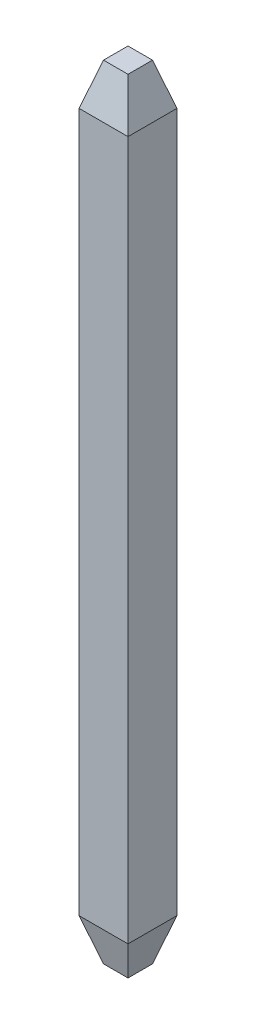
ISO-10303-21;
HEADER;
FILE_DESCRIPTION(('STEP AP214'),'2;1');
FILE_NAME('part.step','',(''),(''),'','','');
FILE_SCHEMA(('AUTOMOTIVE_DESIGN { 1 0 10303 214 1 1 1 1 }'));
ENDSEC;
DATA;
#1=APPLICATION_CONTEXT('core data for automotive mechanical design processes');
#2=APPLICATION_PROTOCOL_DEFINITION('international standard','automotive_design',2000,#1);
#3=PRODUCT_CONTEXT('',#1,'mechanical');
#4=PRODUCT('Part','Part','',(#3));
#5=PRODUCT_RELATED_PRODUCT_CATEGORY('part','',(#4));
#6=PRODUCT_DEFINITION_FORMATION('','',#4);
#7=PRODUCT_DEFINITION_CONTEXT('part definition',#1,'design');
#8=PRODUCT_DEFINITION('design','',#6,#7);
#9=PRODUCT_DEFINITION_SHAPE('','',#8);
#10=(LENGTH_UNIT() NAMED_UNIT(*) SI_UNIT(.MILLI.,.METRE.));
#11=(NAMED_UNIT(*) PLANE_ANGLE_UNIT() SI_UNIT($,.RADIAN.));
#12=(NAMED_UNIT(*) SI_UNIT($,.STERADIAN.) SOLID_ANGLE_UNIT());
#13=UNCERTAINTY_MEASURE_WITH_UNIT(LENGTH_MEASURE(1.E-05),#10,'distance_accuracy_value','');
#14=(GEOMETRIC_REPRESENTATION_CONTEXT(3) GLOBAL_UNCERTAINTY_ASSIGNED_CONTEXT((#13)) GLOBAL_UNIT_ASSIGNED_CONTEXT((#10,
#11,#12)) REPRESENTATION_CONTEXT('',''));
#15=CARTESIAN_POINT('',(0.,0.,0.));
#16=DIRECTION('',(0.,0.,1.));
#17=DIRECTION('',(1.,0.,0.));
#18=AXIS2_PLACEMENT_3D('',#15,#16,#17);
#19=CARTESIAN_POINT('',(-31.269999999987,-11.0738701069128,-16.9799999999763));
#20=DIRECTION('',(1.,0.,0.));
#21=DIRECTION('',(0.,1.,0.));
#22=AXIS2_PLACEMENT_3D('',#19,#20,#21);
#23=PLANE('',#22);
#24=DIRECTION('',(0.,1.,0.));
#25=VECTOR('',#24,1.);
#26=CARTESIAN_POINT('',(-31.269999999987,-10.1039999999833,-16.6599999999763));
#27=LINE('',#26,#25);
#28=CARTESIAN_POINT('',(-31.269999999987,-10.1039999999833,-16.6599999999763));
#29=VERTEX_POINT('',#28);
#30=CARTESIAN_POINT('',(-31.269999999987,-0.965870106912755,-16.6599999999763));
#31=VERTEX_POINT('',#30);
#32=EDGE_CURVE('E153',#29,#31,#27,.T.);
#33=ORIENTED_EDGE('',*,*,#32,.F.);
#34=DIRECTION('',(0.,0.,1.));
#35=VECTOR('',#34,1.);
#36=CARTESIAN_POINT('',(-31.269999999987,-10.1039999999833,-17.2999999999763));
#37=LINE('',#36,#35);
#38=CARTESIAN_POINT('',(-31.269999999987,-10.1039999999833,-17.2999999999763));
#39=VERTEX_POINT('',#38);
#40=EDGE_CURVE('E42',#39,#29,#37,.T.);
#41=ORIENTED_EDGE('',*,*,#40,.F.);
#42=DIRECTION('',(0.,1.,0.));
#43=VECTOR('',#42,1.);
#44=CARTESIAN_POINT('',(-31.269999999987,-10.1039999999833,-17.2999999999763));
#45=LINE('',#44,#43);
#46=CARTESIAN_POINT('',(-31.269999999987,-0.965870106912755,-17.2999999999763));
#47=VERTEX_POINT('',#46);
#48=EDGE_CURVE('E11',#39,#47,#45,.T.);
#49=ORIENTED_EDGE('',*,*,#48,.T.);
#50=DIRECTION('',(0.,0.,1.));
#51=VECTOR('',#50,1.);
#52=CARTESIAN_POINT('',(-31.269999999987,-0.965870106912753,-17.2999999999763));
#53=LINE('',#52,#51);
#54=EDGE_CURVE('E28',#47,#31,#53,.T.);
#55=ORIENTED_EDGE('',*,*,#54,.T.);
#56=EDGE_LOOP('',(#33,#41,#49,#55));
#57=FACE_BOUND('',#56,.T.);
#58=ADVANCED_FACE('F17',(#57),#23,.T.);
#59=CARTESIAN_POINT('',(-31.9109999999869,-5.53543505344803,-16.6599999999763));
#60=DIRECTION('',(0.,0.,1.));
#61=DIRECTION('',(1.,0.,0.));
#62=AXIS2_PLACEMENT_3D('',#59,#60,#61);
#63=PLANE('',#62);
#64=DIRECTION('',(0.,1.,0.));
#65=VECTOR('',#64,1.);
#66=CARTESIAN_POINT('',(-31.909999999987,-10.1039999999833,-16.6599999999763));
#67=LINE('',#66,#65);
#68=CARTESIAN_POINT('',(-31.909999999987,-10.1039999999833,-16.6599999999763));
#69=VERTEX_POINT('',#68);
#70=CARTESIAN_POINT('',(-31.909999999987,-0.965870106912755,-16.6599999999763));
#71=VERTEX_POINT('',#70);
#72=EDGE_CURVE('E21',#69,#71,#67,.T.);
#73=ORIENTED_EDGE('',*,*,#72,.F.);
#74=DIRECTION('',(-1.,0.,0.));
#75=VECTOR('',#74,1.);
#76=CARTESIAN_POINT('',(-31.269999999987,-10.1039999999833,-16.6599999999763));
#77=LINE('',#76,#75);
#78=EDGE_CURVE('E156',#29,#69,#77,.T.);
#79=ORIENTED_EDGE('',*,*,#78,.F.);
#80=ORIENTED_EDGE('',*,*,#32,.T.);
#81=DIRECTION('',(-1.,0.,0.));
#82=VECTOR('',#81,1.);
#83=CARTESIAN_POINT('',(-31.269999999987,-0.965870106912753,-16.6599999999763));
#84=LINE('',#83,#82);
#85=EDGE_CURVE('E185',#31,#71,#84,.T.);
#86=ORIENTED_EDGE('',*,*,#85,.T.);
#87=EDGE_LOOP('',(#73,#79,#80,#86));
#88=FACE_BOUND('',#87,.T.);
#89=ADVANCED_FACE('F268',(#88),#63,.T.);
#90=CARTESIAN_POINT('',(-31.909999999987,-5.53543505344803,-16.6589999999763));
#91=DIRECTION('',(-1.,0.,0.));
#92=DIRECTION('',(0.,0.,1.));
#93=AXIS2_PLACEMENT_3D('',#90,#91,#92);
#94=PLANE('',#93);
#95=DIRECTION('',(0.,1.,0.));
#96=VECTOR('',#95,1.);
#97=CARTESIAN_POINT('',(-31.909999999987,-10.1039999999833,-17.2999999999763));
#98=LINE('',#97,#96);
#99=CARTESIAN_POINT('',(-31.909999999987,-10.1039999999833,-17.2999999999763));
#100=VERTEX_POINT('',#99);
#101=CARTESIAN_POINT('',(-31.909999999987,-0.965870106912755,-17.2999999999763));
#102=VERTEX_POINT('',#101);
#103=EDGE_CURVE('E93',#100,#102,#98,.T.);
#104=ORIENTED_EDGE('',*,*,#103,.F.);
#105=DIRECTION('',(0.,0.,-1.));
#106=VECTOR('',#105,1.);
#107=CARTESIAN_POINT('',(-31.909999999987,-10.1039999999833,-16.6599999999763));
#108=LINE('',#107,#106);
#109=EDGE_CURVE('E98',#69,#100,#108,.T.);
#110=ORIENTED_EDGE('',*,*,#109,.F.);
#111=ORIENTED_EDGE('',*,*,#72,.T.);
#112=DIRECTION('',(0.,0.,-1.));
#113=VECTOR('',#112,1.);
#114=CARTESIAN_POINT('',(-31.909999999987,-0.965870106912753,-16.6599999999763));
#115=LINE('',#114,#113);
#116=EDGE_CURVE('E100',#71,#102,#115,.T.);
#117=ORIENTED_EDGE('',*,*,#116,.T.);
#118=EDGE_LOOP('',(#104,#110,#111,#117));
#119=FACE_BOUND('',#118,.T.);
#120=ADVANCED_FACE('F95',(#119),#94,.T.);
#121=CARTESIAN_POINT('',(-31.909999999987,-0.965870106912753,-16.9799999999763));
#122=DIRECTION('',(-0.959644900900968,0.281214622974644,0.));
#123=DIRECTION('',(0.,0.,1.));
#124=AXIS2_PLACEMENT_3D('',#121,#122,#123);
#125=PLANE('',#124);
#126=DIRECTION('',(0.270714017147727,0.923811583516617,-0.270714017147727));
#127=VECTOR('',#126,1.);
#128=CARTESIAN_POINT('',(-31.909999999987,-0.965870106912753,-16.6599999999763));
#129=LINE('',#128,#127);
#130=CARTESIAN_POINT('',(-31.749999999987,-0.419870106912756,-16.8199999999763));
#131=VERTEX_POINT('',#130);
#132=EDGE_CURVE('E149',#71,#131,#129,.T.);
#133=ORIENTED_EDGE('',*,*,#132,.T.);
#134=DIRECTION('',(0.,0.,-1.));
#135=VECTOR('',#134,1.);
#136=CARTESIAN_POINT('',(-31.749999999987,-0.419870106912754,-16.8199999999763));
#137=LINE('',#136,#135);
#138=CARTESIAN_POINT('',(-31.749999999987,-0.419870106912756,-17.1399999999763));
#139=VERTEX_POINT('',#138);
#140=EDGE_CURVE('E193',#131,#139,#137,.T.);
#141=ORIENTED_EDGE('',*,*,#140,.T.);
#142=DIRECTION('',(0.270714017147727,0.923811583516617,0.270714017147727));
#143=VECTOR('',#142,1.);
#144=CARTESIAN_POINT('',(-31.909999999987,-0.965870106912753,-17.2999999999763));
#145=LINE('',#144,#143);
#146=EDGE_CURVE('E191',#102,#139,#145,.T.);
#147=ORIENTED_EDGE('',*,*,#146,.F.);
#148=ORIENTED_EDGE('',*,*,#116,.F.);
#149=EDGE_LOOP('',(#133,#141,#147,#148));
#150=FACE_BOUND('',#149,.T.);
#151=ADVANCED_FACE('F216',(#150),#125,.T.);
#152=CARTESIAN_POINT('',(-31.589999999987,-0.965870106912753,-17.2999999999763));
#153=DIRECTION('',(0.,0.281214622974644,-0.959644900900968));
#154=DIRECTION('',(-1.,0.,0.));
#155=AXIS2_PLACEMENT_3D('',#152,#153,#154);
#156=PLANE('',#155);
#157=ORIENTED_EDGE('',*,*,#146,.T.);
#158=DIRECTION('',(1.,0.,0.));
#159=VECTOR('',#158,1.);
#160=CARTESIAN_POINT('',(-31.749999999987,-0.419870106912754,-17.1399999999763));
#161=LINE('',#160,#159);
#162=CARTESIAN_POINT('',(-31.429999999987,-0.419870106912756,-17.1399999999763));
#163=VERTEX_POINT('',#162);
#164=EDGE_CURVE('E129',#139,#163,#161,.T.);
#165=ORIENTED_EDGE('',*,*,#164,.T.);
#166=DIRECTION('',(-0.270714017147567,0.92381158351666,0.27071401714774));
#167=VECTOR('',#166,1.);
#168=CARTESIAN_POINT('',(-31.269999999987,-0.965870106912753,-17.2999999999763));
#169=LINE('',#168,#167);
#170=EDGE_CURVE('E157',#47,#163,#169,.T.);
#171=ORIENTED_EDGE('',*,*,#170,.F.);
#172=DIRECTION('',(1.,0.,0.));
#173=VECTOR('',#172,1.);
#174=CARTESIAN_POINT('',(-31.909999999987,-0.965870106912753,-17.2999999999763));
#175=LINE('',#174,#173);
#176=EDGE_CURVE('E108',#102,#47,#175,.T.);
#177=ORIENTED_EDGE('',*,*,#176,.F.);
#178=EDGE_LOOP('',(#157,#165,#171,#177));
#179=FACE_BOUND('',#178,.T.);
#180=ADVANCED_FACE('F204',(#179),#156,.T.);
#181=CARTESIAN_POINT('',(-31.589999999987,-0.419870106912754,-17.1409999999763));
#182=DIRECTION('',(0.,1.,0.));
#183=DIRECTION('',(1.,0.,0.));
#184=AXIS2_PLACEMENT_3D('',#181,#182,#183);
#185=PLANE('',#184);
#186=ORIENTED_EDGE('',*,*,#164,.F.);
#187=ORIENTED_EDGE('',*,*,#140,.F.);
#188=DIRECTION('',(-1.,0.,0.));
#189=VECTOR('',#188,1.);
#190=CARTESIAN_POINT('',(-31.4299999999869,-0.419870106912754,-16.8199999999763));
#191=LINE('',#190,#189);
#192=CARTESIAN_POINT('',(-31.429999999987,-0.419870106912756,-16.8199999999763));
#193=VERTEX_POINT('',#192);
#194=EDGE_CURVE('E160',#193,#131,#191,.T.);
#195=ORIENTED_EDGE('',*,*,#194,.F.);
#196=DIRECTION('',(0.,0.,1.));
#197=VECTOR('',#196,1.);
#198=CARTESIAN_POINT('',(-31.4299999999869,-0.419870106912754,-17.1399999999763));
#199=LINE('',#198,#197);
#200=EDGE_CURVE('E107',#163,#193,#199,.T.);
#201=ORIENTED_EDGE('',*,*,#200,.F.);
#202=EDGE_LOOP('',(#186,#187,#195,#201));
#203=FACE_BOUND('',#202,.T.);
#204=ADVANCED_FACE('F209',(#203),#185,.T.);
#205=CARTESIAN_POINT('',(-31.909999999987,-10.1039999999833,-16.9799999999763));
#206=DIRECTION('',(-0.959644900900969,-0.281214622974642,0.));
#207=DIRECTION('',(-0.281214622974642,0.959644900900969,0.));
#208=AXIS2_PLACEMENT_3D('',#205,#206,#207);
#209=PLANE('',#208);
#210=ORIENTED_EDGE('',*,*,#109,.T.);
#211=DIRECTION('',(0.270714017147726,-0.923811583516618,0.270714017147726));
#212=VECTOR('',#211,1.);
#213=CARTESIAN_POINT('',(-31.909999999987,-10.1039999999833,-17.2999999999763));
#214=LINE('',#213,#212);
#215=CARTESIAN_POINT('',(-31.749999999987,-10.6499999999833,-17.1399999999763));
#216=VERTEX_POINT('',#215);
#217=EDGE_CURVE('E114',#100,#216,#214,.T.);
#218=ORIENTED_EDGE('',*,*,#217,.T.);
#219=DIRECTION('',(0.,0.,-1.));
#220=VECTOR('',#219,1.);
#221=CARTESIAN_POINT('',(-31.749999999987,-10.6499999999833,-16.8199999999763));
#222=LINE('',#221,#220);
#223=CARTESIAN_POINT('',(-31.749999999987,-10.6499999999833,-16.8199999999763));
#224=VERTEX_POINT('',#223);
#225=EDGE_CURVE('E140',#224,#216,#222,.T.);
#226=ORIENTED_EDGE('',*,*,#225,.F.);
#227=DIRECTION('',(0.270714017147726,-0.923811583516618,-0.270714017147726));
#228=VECTOR('',#227,1.);
#229=CARTESIAN_POINT('',(-31.909999999987,-10.1039999999833,-16.6599999999763));
#230=LINE('',#229,#228);
#231=EDGE_CURVE('E127',#69,#224,#230,.T.);
#232=ORIENTED_EDGE('',*,*,#231,.F.);
#233=EDGE_LOOP('',(#210,#218,#226,#232));
#234=FACE_BOUND('',#233,.T.);
#235=ADVANCED_FACE('F126',(#234),#209,.T.);
#236=CARTESIAN_POINT('',(-31.7509999999869,-10.6499999999833,-16.9799999999763));
#237=DIRECTION('',(0.,-1.,0.));
#238=DIRECTION('',(0.,0.,-1.));
#239=AXIS2_PLACEMENT_3D('',#236,#237,#238);
#240=PLANE('',#239);
#241=DIRECTION('',(0.,0.,1.));
#242=VECTOR('',#241,1.);
#243=CARTESIAN_POINT('',(-31.4299999999869,-10.6499999999833,-17.1399999999763));
#244=LINE('',#243,#242);
#245=CARTESIAN_POINT('',(-31.429999999987,-10.6499999999833,-17.1399999999763));
#246=VERTEX_POINT('',#245);
#247=CARTESIAN_POINT('',(-31.429999999987,-10.6499999999833,-16.8199999999763));
#248=VERTEX_POINT('',#247);
#249=EDGE_CURVE('E123',#246,#248,#244,.T.);
#250=ORIENTED_EDGE('',*,*,#249,.T.);
#251=DIRECTION('',(-1.,0.,0.));
#252=VECTOR('',#251,1.);
#253=CARTESIAN_POINT('',(-31.4299999999869,-10.6499999999833,-16.8199999999763));
#254=LINE('',#253,#252);
#255=EDGE_CURVE('E163',#248,#224,#254,.T.);
#256=ORIENTED_EDGE('',*,*,#255,.T.);
#257=ORIENTED_EDGE('',*,*,#225,.T.);
#258=DIRECTION('',(1.,0.,0.));
#259=VECTOR('',#258,1.);
#260=CARTESIAN_POINT('',(-31.749999999987,-10.6499999999833,-17.1399999999763));
#261=LINE('',#260,#259);
#262=EDGE_CURVE('E119',#216,#246,#261,.T.);
#263=ORIENTED_EDGE('',*,*,#262,.T.);
#264=EDGE_LOOP('',(#250,#256,#257,#263));
#265=FACE_BOUND('',#264,.T.);
#266=ADVANCED_FACE('F239',(#265),#240,.T.);
#267=CARTESIAN_POINT('',(-31.589999999987,-10.1039999999833,-17.2999999999763));
#268=DIRECTION('',(0.,-0.281214622974642,-0.959644900900969));
#269=DIRECTION('',(0.,-0.959644900900969,0.281214622974642));
#270=AXIS2_PLACEMENT_3D('',#267,#268,#269);
#271=PLANE('',#270);
#272=DIRECTION('',(1.,0.,0.));
#273=VECTOR('',#272,1.);
#274=CARTESIAN_POINT('',(-31.909999999987,-10.1039999999833,-17.2999999999763));
#275=LINE('',#274,#273);
#276=EDGE_CURVE('E116',#100,#39,#275,.T.);
#277=ORIENTED_EDGE('',*,*,#276,.T.);
#278=DIRECTION('',(-0.270714017147566,-0.923811583516661,0.270714017147739));
#279=VECTOR('',#278,1.);
#280=CARTESIAN_POINT('',(-31.269999999987,-10.1039999999833,-17.2999999999763));
#281=LINE('',#280,#279);
#282=EDGE_CURVE('E133',#39,#246,#281,.T.);
#283=ORIENTED_EDGE('',*,*,#282,.T.);
#284=ORIENTED_EDGE('',*,*,#262,.F.);
#285=ORIENTED_EDGE('',*,*,#217,.F.);
#286=EDGE_LOOP('',(#277,#283,#284,#285));
#287=FACE_BOUND('',#286,.T.);
#288=ADVANCED_FACE('F19',(#287),#271,.T.);
#289=CARTESIAN_POINT('',(-31.589999999987,-0.965870106912753,-16.6599999999763));
#290=DIRECTION('',(0.,0.281214622974644,0.959644900900968));
#291=DIRECTION('',(1.,0.,0.));
#292=AXIS2_PLACEMENT_3D('',#289,#290,#291);
#293=PLANE('',#292);
#294=DIRECTION('',(-0.270714017147567,0.92381158351666,-0.27071401714774));
#295=VECTOR('',#294,1.);
#296=CARTESIAN_POINT('',(-31.269999999987,-0.965870106912753,-16.6599999999763));
#297=LINE('',#296,#295);
#298=EDGE_CURVE('E142',#31,#193,#297,.T.);
#299=ORIENTED_EDGE('',*,*,#298,.T.);
#300=ORIENTED_EDGE('',*,*,#194,.T.);
#301=ORIENTED_EDGE('',*,*,#132,.F.);
#302=ORIENTED_EDGE('',*,*,#85,.F.);
#303=EDGE_LOOP('',(#299,#300,#301,#302));
#304=FACE_BOUND('',#303,.T.);
#305=ADVANCED_FACE('F252',(#304),#293,.T.);
#306=CARTESIAN_POINT('',(-31.589999999987,-10.1039999999833,-16.6599999999763));
#307=DIRECTION('',(0.,-0.281214622974642,0.959644900900969));
#308=DIRECTION('',(-1.,0.,0.));
#309=AXIS2_PLACEMENT_3D('',#306,#307,#308);
#310=PLANE('',#309);
#311=ORIENTED_EDGE('',*,*,#78,.T.);
#312=ORIENTED_EDGE('',*,*,#231,.T.);
#313=ORIENTED_EDGE('',*,*,#255,.F.);
#314=DIRECTION('',(-0.270714017147566,-0.923811583516661,-0.270714017147739));
#315=VECTOR('',#314,1.);
#316=CARTESIAN_POINT('',(-31.269999999987,-10.1039999999833,-16.6599999999763));
#317=LINE('',#316,#315);
#318=EDGE_CURVE('E226',#29,#248,#317,.T.);
#319=ORIENTED_EDGE('',*,*,#318,.F.);
#320=EDGE_LOOP('',(#311,#312,#313,#319));
#321=FACE_BOUND('',#320,.T.);
#322=ADVANCED_FACE('F236',(#321),#310,.T.);
#323=CARTESIAN_POINT('',(-31.269999999987,-0.965870106912753,-16.9799999999763));
#324=DIRECTION('',(0.959644900901017,0.281214622974478,0.));
#325=DIRECTION('',(0.,0.,-1.));
#326=AXIS2_PLACEMENT_3D('',#323,#324,#325);
#327=PLANE('',#326);
#328=ORIENTED_EDGE('',*,*,#170,.T.);
#329=ORIENTED_EDGE('',*,*,#200,.T.);
#330=ORIENTED_EDGE('',*,*,#298,.F.);
#331=ORIENTED_EDGE('',*,*,#54,.F.);
#332=EDGE_LOOP('',(#328,#329,#330,#331));
#333=FACE_BOUND('',#332,.T.);
#334=ADVANCED_FACE('F200',(#333),#327,.T.);
#335=CARTESIAN_POINT('',(-31.2689999999869,-5.53443505344803,-17.2999999999763));
#336=DIRECTION('',(0.,0.,-1.));
#337=DIRECTION('',(0.,-1.,0.));
#338=AXIS2_PLACEMENT_3D('',#335,#336,#337);
#339=PLANE('',#338);
#340=ORIENTED_EDGE('',*,*,#48,.F.);
#341=ORIENTED_EDGE('',*,*,#276,.F.);
#342=ORIENTED_EDGE('',*,*,#103,.T.);
#343=ORIENTED_EDGE('',*,*,#176,.T.);
#344=EDGE_LOOP('',(#340,#341,#342,#343));
#345=FACE_BOUND('',#344,.T.);
#346=ADVANCED_FACE('F131',(#345),#339,.T.);
#347=CARTESIAN_POINT('',(-31.269999999987,-10.1039999999833,-16.9799999999763));
#348=DIRECTION('',(0.959644900901017,-0.281214622974477,0.));
#349=DIRECTION('',(0.,0.,-1.));
#350=AXIS2_PLACEMENT_3D('',#347,#348,#349);
#351=PLANE('',#350);
#352=ORIENTED_EDGE('',*,*,#40,.T.);
#353=ORIENTED_EDGE('',*,*,#318,.T.);
#354=ORIENTED_EDGE('',*,*,#249,.F.);
#355=ORIENTED_EDGE('',*,*,#282,.F.);
#356=EDGE_LOOP('',(#352,#353,#354,#355));
#357=FACE_BOUND('',#356,.T.);
#358=ADVANCED_FACE('F232',(#357),#351,.T.);
#359=CLOSED_SHELL('',(#58,#89,#120,#151,#180,#204,#235,#266,#288,#305,#322,#334,#346,#358));
#360=MANIFOLD_SOLID_BREP('B1',#359);
#361=ADVANCED_BREP_SHAPE_REPRESENTATION('',(#18,#360),#14);
#362=SHAPE_DEFINITION_REPRESENTATION(#9,#361);
ENDSEC;
END-ISO-10303-21;
